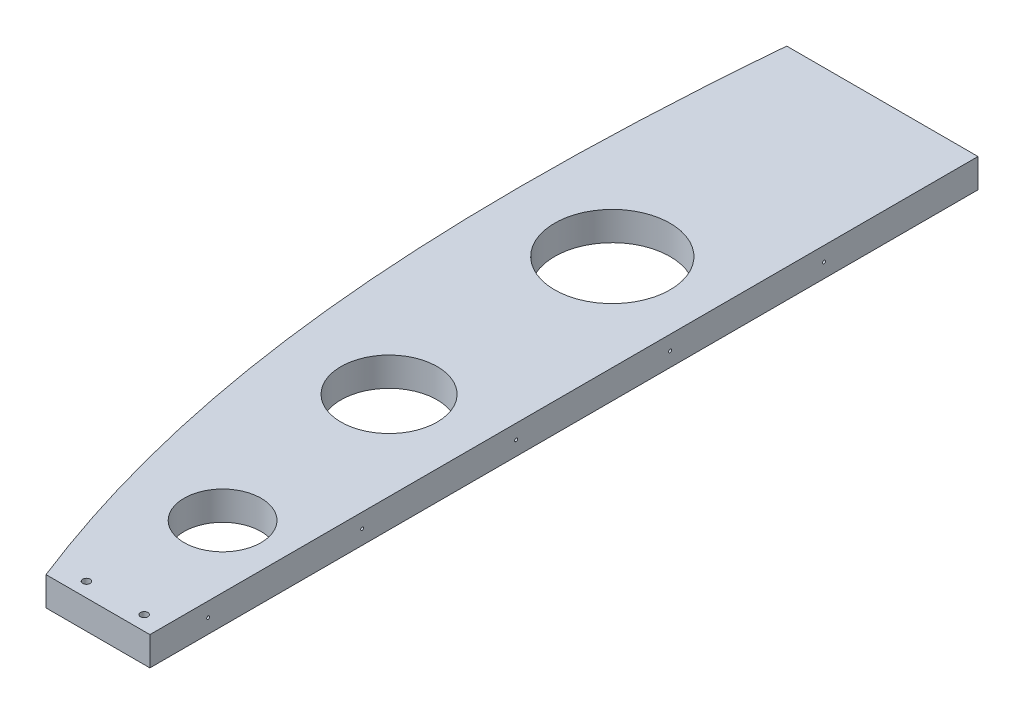
ISO-10303-21;
HEADER;
FILE_DESCRIPTION(('STEP AP214'),'2;1');
FILE_NAME('part.step','',(''),(''),'','','');
FILE_SCHEMA(('AUTOMOTIVE_DESIGN { 1 0 10303 214 1 1 1 1 }'));
ENDSEC;
DATA;
#1=APPLICATION_CONTEXT('core data for automotive mechanical design processes');
#2=APPLICATION_PROTOCOL_DEFINITION('international standard','automotive_design',2000,#1);
#3=PRODUCT_CONTEXT('',#1,'mechanical');
#4=PRODUCT('Part','Part','',(#3));
#5=PRODUCT_RELATED_PRODUCT_CATEGORY('part','',(#4));
#6=PRODUCT_DEFINITION_FORMATION('','',#4);
#7=PRODUCT_DEFINITION_CONTEXT('part definition',#1,'design');
#8=PRODUCT_DEFINITION('design','',#6,#7);
#9=PRODUCT_DEFINITION_SHAPE('','',#8);
#10=(LENGTH_UNIT() NAMED_UNIT(*) SI_UNIT(.MILLI.,.METRE.));
#11=(NAMED_UNIT(*) PLANE_ANGLE_UNIT() SI_UNIT($,.RADIAN.));
#12=(NAMED_UNIT(*) SI_UNIT($,.STERADIAN.) SOLID_ANGLE_UNIT());
#13=UNCERTAINTY_MEASURE_WITH_UNIT(LENGTH_MEASURE(1.E-05),#10,'distance_accuracy_value','');
#14=(GEOMETRIC_REPRESENTATION_CONTEXT(3) GLOBAL_UNCERTAINTY_ASSIGNED_CONTEXT((#13)) GLOBAL_UNIT_ASSIGNED_CONTEXT((#10,
#11,#12)) REPRESENTATION_CONTEXT('',''));
#15=CARTESIAN_POINT('',(0.,0.,0.));
#16=DIRECTION('',(0.,0.,1.));
#17=DIRECTION('',(1.,0.,0.));
#18=AXIS2_PLACEMENT_3D('',#15,#16,#17);
#19=CARTESIAN_POINT('',(-392.720476188399,5372.1,2956.72721358891));
#20=DIRECTION('',(0.,1.,0.));
#21=DIRECTION('',(0.,0.,1.));
#22=AXIS2_PLACEMENT_3D('',#19,#20,#21);
#23=PLANE('',#22);
#24=CARTESIAN_POINT('',(-376.528681754762,5372.1,3220.41942707641));
#25=DIRECTION('',(0.,-1.,0.));
#26=DIRECTION('',(0.,0.,1.));
#27=AXIS2_PLACEMENT_3D('',#24,#25,#26);
#28=CIRCLE('',#27,2.45744999999997);
#29=CARTESIAN_POINT('',(-376.528681754762,5372.1,3222.87687707641));
#30=VERTEX_POINT('',#29);
#31=EDGE_CURVE('E459',#30,#30,#28,.T.);
#32=ORIENTED_EDGE('',*,*,#31,.F.);
#33=EDGE_LOOP('',(#32));
#34=FACE_BOUND('',#33,.T.);
#35=CARTESIAN_POINT('',(-338.428578956923,5372.1,3220.4194270765));
#36=DIRECTION('',(0.,-1.,0.));
#37=DIRECTION('',(0.,0.,1.));
#38=AXIS2_PLACEMENT_3D('',#35,#36,#37);
#39=CIRCLE('',#38,2.45744999999997);
#40=CARTESIAN_POINT('',(-338.428578956923,5372.1,3222.8768770765));
#41=VERTEX_POINT('',#40);
#42=EDGE_CURVE('E116',#41,#41,#39,.T.);
#43=ORIENTED_EDGE('',*,*,#42,.F.);
#44=EDGE_LOOP('',(#43));
#45=FACE_BOUND('',#44,.T.);
#46=CARTESIAN_POINT('',(-388.619999999992,5372.1,2861.31));
#47=DIRECTION('',(0.,-1.,0.));
#48=DIRECTION('',(1.,0.,0.));
#49=AXIS2_PLACEMENT_3D('',#46,#47,#48);
#50=CIRCLE('',#49,38.0999999999997);
#51=CARTESIAN_POINT('',(-350.519999999992,5372.1,2861.31));
#52=VERTEX_POINT('',#51);
#53=EDGE_CURVE('E156',#52,#52,#50,.T.);
#54=ORIENTED_EDGE('',*,*,#53,.F.);
#55=EDGE_LOOP('',(#54));
#56=FACE_BOUND('',#55,.T.);
#57=CARTESIAN_POINT('',(-383.539999999992,5372.1,3013.71));
#58=DIRECTION('',(0.,-1.,0.));
#59=DIRECTION('',(1.,0.,0.));
#60=AXIS2_PLACEMENT_3D('',#57,#58,#59);
#61=CIRCLE('',#60,31.75);
#62=CARTESIAN_POINT('',(-351.789999999992,5372.1,3013.71));
#63=VERTEX_POINT('',#62);
#64=EDGE_CURVE('E484',#63,#63,#61,.T.);
#65=ORIENTED_EDGE('',*,*,#64,.F.);
#66=EDGE_LOOP('',(#65));
#67=FACE_BOUND('',#66,.T.);
#68=CARTESIAN_POINT('',(-366.394999999992,5372.1,3140.71));
#69=DIRECTION('',(0.,-1.,0.));
#70=DIRECTION('',(1.,0.,0.));
#71=AXIS2_PLACEMENT_3D('',#68,#69,#70);
#72=CIRCLE('',#71,25.4);
#73=CARTESIAN_POINT('',(-340.994999999992,5372.1,3140.71));
#74=VERTEX_POINT('',#73);
#75=EDGE_CURVE('E169',#74,#74,#72,.T.);
#76=ORIENTED_EDGE('',*,*,#75,.F.);
#77=EDGE_LOOP('',(#76));
#78=FACE_BOUND('',#77,.T.);
#79=DIRECTION('',(0.,0.,1.));
#80=VECTOR('',#79,1.);
#81=CARTESIAN_POINT('',(-325.12,5372.1,2683.51));
#82=LINE('',#81,#80);
#83=CARTESIAN_POINT('',(-325.12,5372.1,2683.51));
#84=VERTEX_POINT('',#83);
#85=CARTESIAN_POINT('',(-325.12,5372.1,3229.94442717783));
#86=VERTEX_POINT('',#85);
#87=EDGE_CURVE('E161',#84,#86,#82,.T.);
#88=ORIENTED_EDGE('',*,*,#87,.T.);
#89=DIRECTION('',(-1.,0.,0.));
#90=VECTOR('',#89,1.);
#91=CARTESIAN_POINT('',(-325.12,5372.1,3229.94442717783));
#92=LINE('',#91,#90);
#93=CARTESIAN_POINT('',(-393.682548612297,5372.1,3229.94442717783));
#94=VERTEX_POINT('',#93);
#95=EDGE_CURVE('E187',#86,#94,#92,.T.);
#96=ORIENTED_EDGE('',*,*,#95,.T.);
#97=CARTESIAN_POINT('',(-393.682548612297,5372.1,3229.94442717783));
#98=CARTESIAN_POINT('',(-394.456887278261,5372.1,3227.97409267507));
#99=CARTESIAN_POINT('',(-395.224418386659,5372.1,3226.00108202925));
#100=CARTESIAN_POINT('',(-396.745699742087,5372.1,3222.04984801669));
#101=CARTESIAN_POINT('',(-397.499450552644,5372.1,3220.07162486692));
#102=CARTESIAN_POINT('',(-398.993053269483,5372.1,3216.10998577864));
#103=CARTESIAN_POINT('',(-399.732905469336,5372.1,3214.12656995082));
#104=CARTESIAN_POINT('',(-401.198834415247,5372.1,3210.1539474909));
#105=CARTESIAN_POINT('',(-401.92490676605,5372.1,3208.16473923706));
#106=CARTESIAN_POINT('',(-403.362939318137,5372.1,3204.18117724008));
#107=CARTESIAN_POINT('',(-404.074899215258,5372.1,3202.18682338709));
#108=CARTESIAN_POINT('',(-405.484616665228,5372.1,3198.19301213818));
#109=CARTESIAN_POINT('',(-406.182373587812,5372.1,3196.19355452019));
#110=CARTESIAN_POINT('',(-408.953173030683,5372.1,3188.16137490408));
#111=CARTESIAN_POINT('',(-410.968400672618,5372.1,3182.10857083572));
#112=CARTESIAN_POINT('',(-414.867042059988,5372.1,3169.9598314745));
#113=CARTESIAN_POINT('',(-416.750437957193,5372.1,3163.86389046404));
#114=CARTESIAN_POINT('',(-420.384172507284,5372.1,3151.63202096788));
#115=CARTESIAN_POINT('',(-422.13450234528,5372.1,3145.49608986225));
#116=CARTESIAN_POINT('',(-425.501734798348,5372.1,3133.18776982584));
#117=CARTESIAN_POINT('',(-427.118638031934,5372.1,3127.01538106421));
#118=CARTESIAN_POINT('',(-430.220289757622,5372.1,3114.6349025104));
#119=CARTESIAN_POINT('',(-431.704985678233,5372.1,3108.42679955208));
#120=CARTESIAN_POINT('',(-434.542919092933,5372.1,3095.98083496866));
#121=CARTESIAN_POINT('',(-435.896160515653,5372.1,3089.74297423873));
#122=CARTESIAN_POINT('',(-438.473419996919,5372.1,3077.24069251174));
#123=CARTESIAN_POINT('',(-439.697439319748,5372.1,3070.97627177516));
#124=CARTESIAN_POINT('',(-442.019093536706,5372.1,3058.4242371645));
#125=CARTESIAN_POINT('',(-443.116730957581,5372.1,3052.1366237567));
#126=CARTESIAN_POINT('',(-445.53190242202,5372.1,3037.45725662658));
#127=CARTESIAN_POINT('',(-446.8020226021,5372.1,3029.05767164538));
#128=CARTESIAN_POINT('',(-449.133660073008,5372.1,3012.22966620934));
#129=CARTESIAN_POINT('',(-450.195175381903,5372.1,3003.80124548132));
#130=CARTESIAN_POINT('',(-452.119865470589,5372.1,2986.92177852863));
#131=CARTESIAN_POINT('',(-452.983038440592,5372.1,2978.47073209822));
#132=CARTESIAN_POINT('',(-454.52182313745,5372.1,2961.55244648694));
#133=CARTESIAN_POINT('',(-455.197451604686,5372.1,2953.08520881928));
#134=CARTESIAN_POINT('',(-456.372394967282,5372.1,2936.13867906095));
#135=CARTESIAN_POINT('',(-456.871712957139,5372.1,2927.65938718446));
#136=CARTESIAN_POINT('',(-457.49682462189,5372.1,2914.93467998271));
#137=CARTESIAN_POINT('',(-457.68454951338,5372.1,2910.69219806393));
#138=CARTESIAN_POINT('',(-458.020084952675,5372.1,2902.20564766661));
#139=CARTESIAN_POINT('',(-458.16789557835,5372.1,2897.96157919117));
#140=CARTESIAN_POINT('',(-458.39261386685,5372.1,2890.54167375211));
#141=CARTESIAN_POINT('',(-458.478002740263,5372.1,2887.36608909858));
#142=CARTESIAN_POINT('',(-458.62741559634,5372.1,2881.01442207913));
#143=CARTESIAN_POINT('',(-458.69143962297,5372.1,2877.83833971425));
#144=CARTESIAN_POINT('',(-458.798866254698,5372.1,2871.48592736605));
#145=CARTESIAN_POINT('',(-458.842269506911,5372.1,2868.30959739364));
#146=CARTESIAN_POINT('',(-458.909067808656,5372.1,2861.95672988344));
#147=CARTESIAN_POINT('',(-458.932462844902,5372.1,2858.78019234551));
#148=CARTESIAN_POINT('',(-458.973523832038,5372.1,2849.25164706475));
#149=CARTESIAN_POINT('',(-458.962085713271,5372.1,2842.8994936941));
#150=CARTESIAN_POINT('',(-458.865746069073,5372.1,2830.19568475043));
#151=CARTESIAN_POINT('',(-458.780843498029,5372.1,2823.84402918579));
#152=CARTESIAN_POINT('',(-458.555440423178,5372.1,2811.90254793619));
#153=CARTESIAN_POINT('',(-458.422814807489,5372.1,2806.31257153562));
#154=CARTESIAN_POINT('',(-458.105397741391,5372.1,2795.13403521731));
#155=CARTESIAN_POINT('',(-457.920605650512,5372.1,2789.54547531779));
#156=CARTESIAN_POINT('',(-457.50058654664,5372.1,2778.37016686811));
#157=CARTESIAN_POINT('',(-457.265358727712,5372.1,2772.78341834832));
#158=CARTESIAN_POINT('',(-456.745902375998,5372.1,2761.61213595354));
#159=CARTESIAN_POINT('',(-456.461673251714,5372.1,2756.0276021061));
#160=CARTESIAN_POINT('',(-455.845303056687,5372.1,2744.86008184125));
#161=CARTESIAN_POINT('',(-455.513152591962,5372.1,2739.27709594277));
#162=CARTESIAN_POINT('',(-454.801842865255,5372.1,2728.11418570015));
#163=CARTESIAN_POINT('',(-454.422684125743,5372.1,2722.53426132267));
#164=CARTESIAN_POINT('',(-453.617925963619,5372.1,2711.3779283249));
#165=CARTESIAN_POINT('',(-453.192327964684,5372.1,2705.80151960208));
#166=CARTESIAN_POINT('',(-452.519277338355,5372.1,2697.4398551389));
#167=CARTESIAN_POINT('',(-452.289157668395,5372.1,2694.65319423764));
#168=CARTESIAN_POINT('',(-451.817351920112,5372.1,2689.08085188907));
#169=CARTESIAN_POINT('',(-451.575665842301,5372.1,2686.29517044172));
#170=CARTESIAN_POINT('',(-451.328190233737,5372.1,2683.51));
#171=B_SPLINE_CURVE_WITH_KNOTS('',3,(#97,#98,#99,#100,#101,#102,#103,#104,#105,#106,#107,#108,
#109,#110,#111,#112,#113,#114,#115,#116,#117,#118,#119,#120,#121,#122,#123,#124,#125,#126,#127,
#128,#129,#130,#131,#132,#133,#134,#135,#136,#137,#138,#139,#140,#141,#142,#143,#144,#145,#146,
#147,#148,#149,#150,#151,#152,#153,#154,#155,#156,#157,#158,#159,#160,#161,#162,#163,#164,#165,
#166,#167,#168,#169,#170),.UNSPECIFIED.,.F.,.F.,(4,2,2,2,2,2,2,2,2,2,2,2,2,2,2,2,2,2,2,2,2,2,2,
2,2,2,2,2,2,2,2,2,2,2,2,2,4),(0.,6.35108009996956,12.7018998972628,19.0525853991757,
25.4052635958806,31.7580785621476,38.1111748266912,57.2478936892729,76.3871984126718,
95.527769906086,114.66825266624,133.816312856681,152.96380061474,172.111101020311,
191.258018548431,216.74035075125,242.222925047358,267.705731851513,293.186263306885,
318.666347521117,331.40609726997,344.145822164442,353.675953643452,363.206065510394,
372.735878286335,382.265697390113,401.3216964695,420.377966775742,437.152367296034,
453.926973771489,470.701848315528,487.476925363987,504.255295296115,521.033478762763,
537.811148008957,546.199566113043,554.587983845863),.UNSPECIFIED.);
#172=CARTESIAN_POINT('',(-451.328190233737,5372.1,2683.51));
#173=VERTEX_POINT('',#172);
#174=EDGE_CURVE('E174',#94,#173,#171,.T.);
#175=ORIENTED_EDGE('',*,*,#174,.T.);
#176=DIRECTION('',(1.,0.,0.));
#177=VECTOR('',#176,1.);
#178=CARTESIAN_POINT('',(-451.328190233737,5372.1,2683.51));
#179=LINE('',#178,#177);
#180=EDGE_CURVE('E162',#173,#84,#179,.T.);
#181=ORIENTED_EDGE('',*,*,#180,.T.);
#182=EDGE_LOOP('',(#88,#96,#175,#181));
#183=FACE_BOUND('',#182,.T.);
#184=ADVANCED_FACE('F37',(#34,#45,#56,#67,#78,#183),#23,.F.);
#185=CARTESIAN_POINT('',(-325.12,5372.1,3229.94442717783));
#186=DIRECTION('',(0.,0.,1.));
#187=DIRECTION('',(-1.,0.,0.));
#188=AXIS2_PLACEMENT_3D('',#185,#186,#187);
#189=PLANE('',#188);
#190=DIRECTION('',(-1.,0.,0.));
#191=VECTOR('',#190,1.);
#192=CARTESIAN_POINT('',(-392.720476188399,5391.15,3229.94442717783));
#193=LINE('',#192,#191);
#194=CARTESIAN_POINT('',(-325.12,5391.15,3229.94442717783));
#195=VERTEX_POINT('',#194);
#196=CARTESIAN_POINT('',(-393.682548612297,5391.15,3229.94442717783));
#197=VERTEX_POINT('',#196);
#198=EDGE_CURVE('E154',#195,#197,#193,.T.);
#199=ORIENTED_EDGE('',*,*,#198,.T.);
#200=DIRECTION('',(0.,-1.,0.));
#201=VECTOR('',#200,1.);
#202=CARTESIAN_POINT('',(-393.682548612297,5381.625,3229.94442717783));
#203=LINE('',#202,#201);
#204=EDGE_CURVE('E82',#197,#94,#203,.T.);
#205=ORIENTED_EDGE('',*,*,#204,.T.);
#206=ORIENTED_EDGE('',*,*,#95,.F.);
#207=DIRECTION('',(0.,1.,0.));
#208=VECTOR('',#207,1.);
#209=CARTESIAN_POINT('',(-325.12,5372.1,3229.94442717783));
#210=LINE('',#209,#208);
#211=EDGE_CURVE('E170',#86,#195,#210,.T.);
#212=ORIENTED_EDGE('',*,*,#211,.T.);
#213=EDGE_LOOP('',(#199,#205,#206,#212));
#214=FACE_BOUND('',#213,.T.);
#215=ADVANCED_FACE('F232',(#214),#189,.T.);
#216=CARTESIAN_POINT('',(-393.682548612297,5372.1,3229.94442717783));
#217=CARTESIAN_POINT('',(-393.682548612297,5391.15,3229.94442717783));
#218=CARTESIAN_POINT('',(-433.140972393041,5372.1,3129.54068836821));
#219=CARTESIAN_POINT('',(-433.140972393041,5391.15,3129.54068836821));
#220=CARTESIAN_POINT('',(-454.834742459105,5372.1,3022.43692802554));
#221=CARTESIAN_POINT('',(-454.834742459105,5391.15,3022.43692802554));
#222=CARTESIAN_POINT('',(-460.312828518181,5372.1,2819.19788970161));
#223=CARTESIAN_POINT('',(-460.312828518181,5391.15,2819.19788970161));
#224=CARTESIAN_POINT('',(-457.003208667205,5372.1,2747.37762040659));
#225=CARTESIAN_POINT('',(-457.003208667205,5391.15,2747.37762040659));
#226=CARTESIAN_POINT('',(-451.328190233737,5372.1,2683.51));
#227=CARTESIAN_POINT('',(-451.328190233737,5391.15,2683.51));
#228=B_SPLINE_SURFACE_WITH_KNOTS('',3,1,((#216,#217),(#218,#219),(#220,#221),(#222,#223),(#224,
#225),(#226,#227)),.UNSPECIFIED.,.F.,.F.,.F.,(4,2,4),(2,2),(-54.2493510406912,-24.5787816023228,
-9.05068072297407),(0.,1.90499999999997),.UNSPECIFIED.);
#229=CARTESIAN_POINT('',(-393.682548612297,5391.15,3229.94442717783));
#230=CARTESIAN_POINT('',(-394.45688727826,5391.15,3227.97409267507));
#231=CARTESIAN_POINT('',(-395.224418386658,5391.15,3226.00108202925));
#232=CARTESIAN_POINT('',(-396.745699742086,5391.15,3222.04984801669));
#233=CARTESIAN_POINT('',(-397.499450552644,5391.15,3220.07162486692));
#234=CARTESIAN_POINT('',(-398.993053269483,5391.15,3216.10998577864));
#235=CARTESIAN_POINT('',(-399.732905469336,5391.15,3214.12656995082));
#236=CARTESIAN_POINT('',(-401.198834415247,5391.15,3210.1539474909));
#237=CARTESIAN_POINT('',(-401.924906766051,5391.15,3208.16473923706));
#238=CARTESIAN_POINT('',(-403.362939318138,5391.15,3204.18117724008));
#239=CARTESIAN_POINT('',(-404.074899215258,5391.15,3202.18682338709));
#240=CARTESIAN_POINT('',(-405.484616665227,5391.15,3198.19301213818));
#241=CARTESIAN_POINT('',(-406.182373587811,5391.15,3196.19355452019));
#242=CARTESIAN_POINT('',(-408.953173030683,5391.15,3188.16137490408));
#243=CARTESIAN_POINT('',(-410.968400672618,5391.15,3182.10857083572));
#244=CARTESIAN_POINT('',(-414.867042059988,5391.15,3169.9598314745));
#245=CARTESIAN_POINT('',(-416.750437957193,5391.15,3163.86389046404));
#246=CARTESIAN_POINT('',(-420.384172507284,5391.15,3151.63202096788));
#247=CARTESIAN_POINT('',(-422.13450234528,5391.15,3145.49608986225));
#248=CARTESIAN_POINT('',(-425.501734798348,5391.15,3133.18776982584));
#249=CARTESIAN_POINT('',(-427.118638031934,5391.15,3127.01538106421));
#250=CARTESIAN_POINT('',(-430.220289757622,5391.15,3114.6349025104));
#251=CARTESIAN_POINT('',(-431.704985678233,5391.15,3108.42679955208));
#252=CARTESIAN_POINT('',(-434.542919092933,5391.15,3095.98083496866));
#253=CARTESIAN_POINT('',(-435.896160515653,5391.15,3089.74297423873));
#254=CARTESIAN_POINT('',(-438.473419996919,5391.15,3077.24069251174));
#255=CARTESIAN_POINT('',(-439.697439319748,5391.15,3070.97627177516));
#256=CARTESIAN_POINT('',(-442.019093536706,5391.15,3058.4242371645));
#257=CARTESIAN_POINT('',(-443.116730957581,5391.15,3052.1366237567));
#258=CARTESIAN_POINT('',(-445.53190242202,5391.15,3037.45725662658));
#259=CARTESIAN_POINT('',(-446.8020226021,5391.15,3029.05767164538));
#260=CARTESIAN_POINT('',(-449.133660073008,5391.15,3012.22966620934));
#261=CARTESIAN_POINT('',(-450.195175381904,5391.15,3003.80124548132));
#262=CARTESIAN_POINT('',(-452.119865470589,5391.15,2986.92177852863));
#263=CARTESIAN_POINT('',(-452.983038440592,5391.15,2978.47073209822));
#264=CARTESIAN_POINT('',(-454.52182313745,5391.15,2961.55244648694));
#265=CARTESIAN_POINT('',(-455.197451604686,5391.15,2953.08520881928));
#266=CARTESIAN_POINT('',(-456.372394967282,5391.15,2936.13867906095));
#267=CARTESIAN_POINT('',(-456.871712957139,5391.15,2927.65938718446));
#268=CARTESIAN_POINT('',(-457.49682462189,5391.15,2914.93467998271));
#269=CARTESIAN_POINT('',(-457.68454951338,5391.15,2910.69219806393));
#270=CARTESIAN_POINT('',(-458.020084952675,5391.15,2902.20564766661));
#271=CARTESIAN_POINT('',(-458.16789557835,5391.15,2897.96157919117));
#272=CARTESIAN_POINT('',(-458.39261386685,5391.15,2890.54167375211));
#273=CARTESIAN_POINT('',(-458.478002740263,5391.15,2887.36608909858));
#274=CARTESIAN_POINT('',(-458.62741559634,5391.15,2881.01442207913));
#275=CARTESIAN_POINT('',(-458.69143962297,5391.15,2877.83833971425));
#276=CARTESIAN_POINT('',(-458.798866254698,5391.15,2871.48592736605));
#277=CARTESIAN_POINT('',(-458.842269506911,5391.15,2868.30959739364));
#278=CARTESIAN_POINT('',(-458.909067808656,5391.15,2861.95672988344));
#279=CARTESIAN_POINT('',(-458.932462844902,5391.15,2858.78019234551));
#280=CARTESIAN_POINT('',(-458.973523832038,5391.15,2849.25164706475));
#281=CARTESIAN_POINT('',(-458.962085713271,5391.15,2842.8994936941));
#282=CARTESIAN_POINT('',(-458.865746069073,5391.15,2830.19568475043));
#283=CARTESIAN_POINT('',(-458.780843498029,5391.15,2823.84402918579));
#284=CARTESIAN_POINT('',(-458.555440423178,5391.15,2811.90254793619));
#285=CARTESIAN_POINT('',(-458.422814807489,5391.15,2806.31257153562));
#286=CARTESIAN_POINT('',(-458.105397741391,5391.15,2795.13403521731));
#287=CARTESIAN_POINT('',(-457.920605650512,5391.15,2789.54547531779));
#288=CARTESIAN_POINT('',(-457.50058654664,5391.15,2778.37016686811));
#289=CARTESIAN_POINT('',(-457.265358727712,5391.15,2772.78341834832));
#290=CARTESIAN_POINT('',(-456.745902375998,5391.15,2761.61213595354));
#291=CARTESIAN_POINT('',(-456.461673251714,5391.15,2756.0276021061));
#292=CARTESIAN_POINT('',(-455.845303056687,5391.15,2744.86008184125));
#293=CARTESIAN_POINT('',(-455.513152591963,5391.15,2739.27709594277));
#294=CARTESIAN_POINT('',(-454.801842865255,5391.15,2728.11418570015));
#295=CARTESIAN_POINT('',(-454.422684125743,5391.15,2722.53426132267));
#296=CARTESIAN_POINT('',(-453.617925963619,5391.15,2711.3779283249));
#297=CARTESIAN_POINT('',(-453.192327964684,5391.15,2705.80151960208));
#298=CARTESIAN_POINT('',(-452.519277338355,5391.15,2697.4398551389));
#299=CARTESIAN_POINT('',(-452.289157668395,5391.15,2694.65319423764));
#300=CARTESIAN_POINT('',(-451.817351920112,5391.15,2689.08085188907));
#301=CARTESIAN_POINT('',(-451.575665842301,5391.15,2686.29517044172));
#302=CARTESIAN_POINT('',(-451.328190233737,5391.15,2683.51));
#303=B_SPLINE_CURVE_WITH_KNOTS('',3,(#229,#230,#231,#232,#233,#234,#235,#236,#237,#238,#239,
#240,#241,#242,#243,#244,#245,#246,#247,#248,#249,#250,#251,#252,#253,#254,#255,#256,#257,#258,
#259,#260,#261,#262,#263,#264,#265,#266,#267,#268,#269,#270,#271,#272,#273,#274,#275,#276,#277,
#278,#279,#280,#281,#282,#283,#284,#285,#286,#287,#288,#289,#290,#291,#292,#293,#294,#295,#296,
#297,#298,#299,#300,#301,#302),.UNSPECIFIED.,.F.,.F.,(4,2,2,2,2,2,2,2,2,2,2,2,2,2,2,2,2,2,2,2,2,
2,2,2,2,2,2,2,2,2,2,2,2,2,2,2,4),(0.,6.35108009996983,12.7018998972628,19.0525853991757,
25.4052635958808,31.7580785621479,38.1111748266912,57.2478936892729,76.3871984126718,
95.527769906086,114.66825266624,133.816312856681,152.96380061474,172.111101020311,
191.258018548431,216.74035075125,242.222925047358,267.705731851513,293.186263306885,
318.666347521117,331.40609726997,344.145822164442,353.675953643452,363.206065510394,
372.735878286335,382.265697390113,401.3216964695,420.377966775742,437.152367296034,
453.926973771489,470.701848315528,487.476925363987,504.255295296115,521.033478762763,
537.811148008957,546.199566113043,554.587983845863),.UNSPECIFIED.);
#304=CARTESIAN_POINT('',(-451.328190233737,5391.15,2683.51));
#305=VERTEX_POINT('',#304);
#306=EDGE_CURVE('E151',#197,#305,#303,.T.);
#307=DIRECTION('',(0.,1.,0.));
#308=VECTOR('',#307,1.);
#309=CARTESIAN_POINT('',(-451.328190233737,5372.1,2683.51));
#310=LINE('',#309,#308);
#311=EDGE_CURVE('E159',#305,#173,#310,.F.);
#312=ORIENTED_EDGE('',*,*,#306,.T.);
#313=ORIENTED_EDGE('',*,*,#311,.T.);
#314=ORIENTED_EDGE('',*,*,#174,.F.);
#315=ORIENTED_EDGE('',*,*,#204,.F.);
#316=EDGE_LOOP('',(#312,#313,#314,#315));
#317=FACE_BOUND('',#316,.T.);
#318=ADVANCED_FACE('F39',(#317),#228,.F.);
#319=CARTESIAN_POINT('',(-451.328190233737,5372.1,2683.51));
#320=DIRECTION('',(0.,0.,-1.));
#321=DIRECTION('',(1.,0.,0.));
#322=AXIS2_PLACEMENT_3D('',#319,#320,#321);
#323=PLANE('',#322);
#324=CARTESIAN_POINT('',(-419.531342480865,5381.625,2683.51));
#325=DIRECTION('',(0.,0.,1.));
#326=DIRECTION('',(1.,0.,0.));
#327=AXIS2_PLACEMENT_3D('',#324,#325,#326);
#328=CIRCLE('',#327,0.991870000000006);
#329=CARTESIAN_POINT('',(-418.539472480865,5381.625,2683.51));
#330=VERTEX_POINT('',#329);
#331=EDGE_CURVE('E143',#330,#330,#328,.T.);
#332=ORIENTED_EDGE('',*,*,#331,.T.);
#333=EDGE_LOOP('',(#332));
#334=FACE_BOUND('',#333,.T.);
#335=CARTESIAN_POINT('',(-356.590447493622,5381.625,2683.51));
#336=DIRECTION('',(0.,0.,1.));
#337=DIRECTION('',(1.,0.,0.));
#338=AXIS2_PLACEMENT_3D('',#335,#336,#337);
#339=CIRCLE('',#338,0.991870000000006);
#340=CARTESIAN_POINT('',(-355.598577493622,5381.625,2683.51));
#341=VERTEX_POINT('',#340);
#342=EDGE_CURVE('E147',#341,#341,#339,.T.);
#343=ORIENTED_EDGE('',*,*,#342,.T.);
#344=EDGE_LOOP('',(#343));
#345=FACE_BOUND('',#344,.T.);
#346=DIRECTION('',(-1.,0.,0.));
#347=VECTOR('',#346,1.);
#348=CARTESIAN_POINT('',(-392.720476188399,5391.15,2683.51));
#349=LINE('',#348,#347);
#350=CARTESIAN_POINT('',(-325.12,5391.15,2683.51));
#351=VERTEX_POINT('',#350);
#352=EDGE_CURVE('E148',#305,#351,#349,.F.);
#353=ORIENTED_EDGE('',*,*,#352,.T.);
#354=DIRECTION('',(0.,1.,0.));
#355=VECTOR('',#354,1.);
#356=CARTESIAN_POINT('',(-325.12,5372.1,2683.51));
#357=LINE('',#356,#355);
#358=EDGE_CURVE('E167',#351,#84,#357,.F.);
#359=ORIENTED_EDGE('',*,*,#358,.T.);
#360=ORIENTED_EDGE('',*,*,#180,.F.);
#361=ORIENTED_EDGE('',*,*,#311,.F.);
#362=EDGE_LOOP('',(#353,#359,#360,#361));
#363=FACE_BOUND('',#362,.T.);
#364=ADVANCED_FACE('F227',(#334,#345,#363),#323,.T.);
#365=CARTESIAN_POINT('',(-325.12,5372.1,2683.51));
#366=DIRECTION('',(1.,0.,0.));
#367=DIRECTION('',(0.,0.,1.));
#368=AXIS2_PLACEMENT_3D('',#365,#366,#367);
#369=PLANE('',#368);
#370=CARTESIAN_POINT('',(-325.12,5381.625,2785.11));
#371=DIRECTION('',(-1.,0.,0.));
#372=DIRECTION('',(0.,0.,1.));
#373=AXIS2_PLACEMENT_3D('',#370,#371,#372);
#374=CIRCLE('',#373,0.991870000000006);
#375=CARTESIAN_POINT('',(-325.12,5381.625,2786.10187));
#376=VERTEX_POINT('',#375);
#377=EDGE_CURVE('E44',#376,#376,#374,.T.);
#378=ORIENTED_EDGE('',*,*,#377,.T.);
#379=EDGE_LOOP('',(#378));
#380=FACE_BOUND('',#379,.T.);
#381=CARTESIAN_POINT('',(-325.12,5381.625,2886.71));
#382=DIRECTION('',(-1.,0.,0.));
#383=DIRECTION('',(0.,0.,1.));
#384=AXIS2_PLACEMENT_3D('',#381,#382,#383);
#385=CIRCLE('',#384,0.991870000000006);
#386=CARTESIAN_POINT('',(-325.12,5381.625,2887.70187));
#387=VERTEX_POINT('',#386);
#388=EDGE_CURVE('E127',#387,#387,#385,.T.);
#389=ORIENTED_EDGE('',*,*,#388,.T.);
#390=EDGE_LOOP('',(#389));
#391=FACE_BOUND('',#390,.T.);
#392=CARTESIAN_POINT('',(-325.12,5381.625,2988.31));
#393=DIRECTION('',(-1.,0.,0.));
#394=DIRECTION('',(0.,0.,1.));
#395=AXIS2_PLACEMENT_3D('',#392,#393,#394);
#396=CIRCLE('',#395,0.991870000000006);
#397=CARTESIAN_POINT('',(-325.12,5381.625,2989.30187));
#398=VERTEX_POINT('',#397);
#399=EDGE_CURVE('E131',#398,#398,#396,.T.);
#400=ORIENTED_EDGE('',*,*,#399,.T.);
#401=EDGE_LOOP('',(#400));
#402=FACE_BOUND('',#401,.T.);
#403=CARTESIAN_POINT('',(-325.12,5381.625,3089.91));
#404=DIRECTION('',(-1.,0.,0.));
#405=DIRECTION('',(0.,0.,1.));
#406=AXIS2_PLACEMENT_3D('',#403,#404,#405);
#407=CIRCLE('',#406,0.991870000000006);
#408=CARTESIAN_POINT('',(-325.12,5381.625,3090.90187));
#409=VERTEX_POINT('',#408);
#410=EDGE_CURVE('E135',#409,#409,#407,.T.);
#411=ORIENTED_EDGE('',*,*,#410,.T.);
#412=EDGE_LOOP('',(#411));
#413=FACE_BOUND('',#412,.T.);
#414=CARTESIAN_POINT('',(-325.12,5381.625,3191.51));
#415=DIRECTION('',(-1.,0.,0.));
#416=DIRECTION('',(0.,0.,1.));
#417=AXIS2_PLACEMENT_3D('',#414,#415,#416);
#418=CIRCLE('',#417,0.991870000000006);
#419=CARTESIAN_POINT('',(-325.12,5381.625,3192.50187));
#420=VERTEX_POINT('',#419);
#421=EDGE_CURVE('E139',#420,#420,#418,.T.);
#422=ORIENTED_EDGE('',*,*,#421,.T.);
#423=EDGE_LOOP('',(#422));
#424=FACE_BOUND('',#423,.T.);
#425=DIRECTION('',(0.,0.,1.));
#426=VECTOR('',#425,1.);
#427=CARTESIAN_POINT('',(-325.12,5391.15,2956.72721358891));
#428=LINE('',#427,#426);
#429=EDGE_CURVE('E59',#351,#195,#428,.T.);
#430=ORIENTED_EDGE('',*,*,#429,.T.);
#431=ORIENTED_EDGE('',*,*,#211,.F.);
#432=ORIENTED_EDGE('',*,*,#87,.F.);
#433=ORIENTED_EDGE('',*,*,#358,.F.);
#434=EDGE_LOOP('',(#430,#431,#432,#433));
#435=FACE_BOUND('',#434,.T.);
#436=ADVANCED_FACE('F223',(#380,#391,#402,#413,#424,#435),#369,.T.);
#437=CARTESIAN_POINT('',(-366.395,5194.3,3140.71));
#438=DIRECTION('',(0.,1.,0.));
#439=DIRECTION('',(1.,0.,0.));
#440=AXIS2_PLACEMENT_3D('',#437,#438,#439);
#441=CYLINDRICAL_SURFACE('',#440,25.4);
#442=ORIENTED_EDGE('',*,*,#75,.T.);
#443=EDGE_LOOP('',(#442));
#444=FACE_BOUND('',#443,.T.);
#445=CARTESIAN_POINT('',(-366.394999999991,5391.15,3140.71));
#446=DIRECTION('',(0.,-1.,0.));
#447=DIRECTION('',(1.,0.,0.));
#448=AXIS2_PLACEMENT_3D('',#445,#446,#447);
#449=CIRCLE('',#448,25.4);
#450=CARTESIAN_POINT('',(-340.994999999991,5391.15,3140.71));
#451=VERTEX_POINT('',#450);
#452=EDGE_CURVE('E164',#451,#451,#449,.F.);
#453=ORIENTED_EDGE('',*,*,#452,.T.);
#454=EDGE_LOOP('',(#453));
#455=FACE_BOUND('',#454,.T.);
#456=ADVANCED_FACE('F219',(#444,#455),#441,.F.);
#457=CARTESIAN_POINT('',(-383.54,5194.3,3013.71));
#458=DIRECTION('',(0.,1.,0.));
#459=DIRECTION('',(1.,0.,0.));
#460=AXIS2_PLACEMENT_3D('',#457,#458,#459);
#461=CYLINDRICAL_SURFACE('',#460,31.75);
#462=ORIENTED_EDGE('',*,*,#64,.T.);
#463=EDGE_LOOP('',(#462));
#464=FACE_BOUND('',#463,.T.);
#465=CARTESIAN_POINT('',(-383.539999999991,5391.15,3013.71));
#466=DIRECTION('',(0.,-1.,0.));
#467=DIRECTION('',(1.,0.,0.));
#468=AXIS2_PLACEMENT_3D('',#465,#466,#467);
#469=CIRCLE('',#468,31.75);
#470=CARTESIAN_POINT('',(-351.789999999991,5391.15,3013.71));
#471=VERTEX_POINT('',#470);
#472=EDGE_CURVE('E50',#471,#471,#469,.F.);
#473=ORIENTED_EDGE('',*,*,#472,.T.);
#474=EDGE_LOOP('',(#473));
#475=FACE_BOUND('',#474,.T.);
#476=ADVANCED_FACE('F215',(#464,#475),#461,.F.);
#477=CARTESIAN_POINT('',(-388.62,5194.3,2861.31));
#478=DIRECTION('',(0.,1.,0.));
#479=DIRECTION('',(1.,0.,0.));
#480=AXIS2_PLACEMENT_3D('',#477,#478,#479);
#481=CYLINDRICAL_SURFACE('',#480,38.0999999999997);
#482=ORIENTED_EDGE('',*,*,#53,.T.);
#483=EDGE_LOOP('',(#482));
#484=FACE_BOUND('',#483,.T.);
#485=CARTESIAN_POINT('',(-388.619999999991,5391.15,2861.31));
#486=DIRECTION('',(0.,-1.,0.));
#487=DIRECTION('',(1.,0.,0.));
#488=AXIS2_PLACEMENT_3D('',#485,#486,#487);
#489=CIRCLE('',#488,38.0999999999997);
#490=CARTESIAN_POINT('',(-350.519999999992,5391.15,2861.31));
#491=VERTEX_POINT('',#490);
#492=EDGE_CURVE('E11',#491,#491,#489,.F.);
#493=ORIENTED_EDGE('',*,*,#492,.T.);
#494=EDGE_LOOP('',(#493));
#495=FACE_BOUND('',#494,.T.);
#496=ADVANCED_FACE('F210',(#484,#495),#481,.F.);
#497=CARTESIAN_POINT('',(-392.720476188399,5391.15,2956.72721358891));
#498=DIRECTION('',(0.,1.,0.));
#499=DIRECTION('',(0.,0.,1.));
#500=AXIS2_PLACEMENT_3D('',#497,#498,#499);
#501=PLANE('',#500);
#502=CARTESIAN_POINT('',(-376.528681754762,5391.15,3220.41942707641));
#503=DIRECTION('',(0.,-1.,0.));
#504=DIRECTION('',(0.,0.,1.));
#505=AXIS2_PLACEMENT_3D('',#502,#503,#504);
#506=CIRCLE('',#505,2.45744999999997);
#507=CARTESIAN_POINT('',(-376.528681754762,5391.15,3222.87687707641));
#508=VERTEX_POINT('',#507);
#509=EDGE_CURVE('E456',#508,#508,#506,.T.);
#510=ORIENTED_EDGE('',*,*,#509,.T.);
#511=EDGE_LOOP('',(#510));
#512=FACE_BOUND('',#511,.T.);
#513=CARTESIAN_POINT('',(-338.428578956923,5391.15,3220.4194270765));
#514=DIRECTION('',(0.,-1.,0.));
#515=DIRECTION('',(0.,0.,1.));
#516=AXIS2_PLACEMENT_3D('',#513,#514,#515);
#517=CIRCLE('',#516,2.45744999999997);
#518=CARTESIAN_POINT('',(-338.428578956923,5391.15,3222.8768770765));
#519=VERTEX_POINT('',#518);
#520=EDGE_CURVE('E121',#519,#519,#517,.T.);
#521=ORIENTED_EDGE('',*,*,#520,.T.);
#522=EDGE_LOOP('',(#521));
#523=FACE_BOUND('',#522,.T.);
#524=ORIENTED_EDGE('',*,*,#492,.F.);
#525=EDGE_LOOP('',(#524));
#526=FACE_BOUND('',#525,.T.);
#527=ORIENTED_EDGE('',*,*,#472,.F.);
#528=EDGE_LOOP('',(#527));
#529=FACE_BOUND('',#528,.T.);
#530=ORIENTED_EDGE('',*,*,#452,.F.);
#531=EDGE_LOOP('',(#530));
#532=FACE_BOUND('',#531,.T.);
#533=ORIENTED_EDGE('',*,*,#352,.F.);
#534=ORIENTED_EDGE('',*,*,#306,.F.);
#535=ORIENTED_EDGE('',*,*,#198,.F.);
#536=ORIENTED_EDGE('',*,*,#429,.F.);
#537=EDGE_LOOP('',(#533,#534,#535,#536));
#538=FACE_BOUND('',#537,.T.);
#539=ADVANCED_FACE('F204',(#512,#523,#526,#529,#532,#538),#501,.T.);
#540=CARTESIAN_POINT('',(-356.590447493622,5381.625,2702.56));
#541=DIRECTION('',(0.,0.,-1.));
#542=DIRECTION('',(1.,0.,0.));
#543=AXIS2_PLACEMENT_3D('',#540,#541,#542);
#544=CONICAL_SURFACE('',#543,0.991870000000006,1.02974425867677);
#545=CARTESIAN_POINT('',(-356.590447493622,5381.625,2703.1559756222));
#546=VERTEX_POINT('',#545);
#547=VERTEX_LOOP('',#546);
#548=FACE_BOUND('',#547,.T.);
#549=CARTESIAN_POINT('',(-356.590447493622,5381.625,2702.56));
#550=DIRECTION('',(0.,0.,1.));
#551=DIRECTION('',(1.,0.,0.));
#552=AXIS2_PLACEMENT_3D('',#549,#550,#551);
#553=CIRCLE('',#552,0.991870000000006);
#554=CARTESIAN_POINT('',(-355.598577493622,5381.625,2702.56));
#555=VERTEX_POINT('',#554);
#556=EDGE_CURVE('E144',#555,#555,#553,.T.);
#557=ORIENTED_EDGE('',*,*,#556,.F.);
#558=EDGE_LOOP('',(#557));
#559=FACE_BOUND('',#558,.T.);
#560=ADVANCED_FACE('F209',(#548,#559),#544,.F.);
#561=CARTESIAN_POINT('',(-356.590447493622,5381.625,2664.46));
#562=DIRECTION('',(0.,0.,-1.));
#563=DIRECTION('',(1.,0.,0.));
#564=AXIS2_PLACEMENT_3D('',#561,#562,#563);
#565=CYLINDRICAL_SURFACE('',#564,0.991870000000006);
#566=ORIENTED_EDGE('',*,*,#342,.F.);
#567=EDGE_LOOP('',(#566));
#568=FACE_BOUND('',#567,.T.);
#569=ORIENTED_EDGE('',*,*,#556,.T.);
#570=EDGE_LOOP('',(#569));
#571=FACE_BOUND('',#570,.T.);
#572=ADVANCED_FACE('F301',(#568,#571),#565,.F.);
#573=CARTESIAN_POINT('',(-419.531342480865,5381.625,2702.56));
#574=DIRECTION('',(0.,0.,-1.));
#575=DIRECTION('',(1.,0.,0.));
#576=AXIS2_PLACEMENT_3D('',#573,#574,#575);
#577=CONICAL_SURFACE('',#576,0.991870000000006,1.02974425867677);
#578=CARTESIAN_POINT('',(-419.531342480865,5381.625,2703.1559756222));
#579=VERTEX_POINT('',#578);
#580=VERTEX_LOOP('',#579);
#581=FACE_BOUND('',#580,.T.);
#582=CARTESIAN_POINT('',(-419.531342480865,5381.625,2702.56));
#583=DIRECTION('',(0.,0.,1.));
#584=DIRECTION('',(1.,0.,0.));
#585=AXIS2_PLACEMENT_3D('',#582,#583,#584);
#586=CIRCLE('',#585,0.991870000000006);
#587=CARTESIAN_POINT('',(-418.539472480865,5381.625,2702.56));
#588=VERTEX_POINT('',#587);
#589=EDGE_CURVE('E140',#588,#588,#586,.T.);
#590=ORIENTED_EDGE('',*,*,#589,.F.);
#591=EDGE_LOOP('',(#590));
#592=FACE_BOUND('',#591,.T.);
#593=ADVANCED_FACE('F298',(#581,#592),#577,.F.);
#594=CARTESIAN_POINT('',(-419.531342480865,5381.625,2664.46));
#595=DIRECTION('',(0.,0.,-1.));
#596=DIRECTION('',(1.,0.,0.));
#597=AXIS2_PLACEMENT_3D('',#594,#595,#596);
#598=CYLINDRICAL_SURFACE('',#597,0.991870000000006);
#599=ORIENTED_EDGE('',*,*,#331,.F.);
#600=EDGE_LOOP('',(#599));
#601=FACE_BOUND('',#600,.T.);
#602=ORIENTED_EDGE('',*,*,#589,.T.);
#603=EDGE_LOOP('',(#602));
#604=FACE_BOUND('',#603,.T.);
#605=ADVANCED_FACE('F294',(#601,#604),#598,.F.);
#606=CARTESIAN_POINT('',(-344.17,5381.625,3191.51));
#607=DIRECTION('',(1.,0.,0.));
#608=DIRECTION('',(0.,0.,1.));
#609=AXIS2_PLACEMENT_3D('',#606,#607,#608);
#610=CONICAL_SURFACE('',#609,0.991870000000006,1.02974425867665);
#611=CARTESIAN_POINT('',(-344.765975622195,5381.625,3191.51));
#612=VERTEX_POINT('',#611);
#613=VERTEX_LOOP('',#612);
#614=FACE_BOUND('',#613,.T.);
#615=CARTESIAN_POINT('',(-344.17,5381.625,3191.51));
#616=DIRECTION('',(-1.,0.,0.));
#617=DIRECTION('',(0.,0.,1.));
#618=AXIS2_PLACEMENT_3D('',#615,#616,#617);
#619=CIRCLE('',#618,0.991870000000006);
#620=CARTESIAN_POINT('',(-344.17,5381.625,3192.50187));
#621=VERTEX_POINT('',#620);
#622=EDGE_CURVE('E136',#621,#621,#619,.T.);
#623=ORIENTED_EDGE('',*,*,#622,.F.);
#624=EDGE_LOOP('',(#623));
#625=FACE_BOUND('',#624,.T.);
#626=ADVANCED_FACE('F290',(#614,#625),#610,.F.);
#627=CARTESIAN_POINT('',(-312.42,5381.625,3191.51));
#628=DIRECTION('',(1.,0.,0.));
#629=DIRECTION('',(0.,0.,1.));
#630=AXIS2_PLACEMENT_3D('',#627,#628,#629);
#631=CYLINDRICAL_SURFACE('',#630,0.991870000000006);
#632=ORIENTED_EDGE('',*,*,#421,.F.);
#633=EDGE_LOOP('',(#632));
#634=FACE_BOUND('',#633,.T.);
#635=ORIENTED_EDGE('',*,*,#622,.T.);
#636=EDGE_LOOP('',(#635));
#637=FACE_BOUND('',#636,.T.);
#638=ADVANCED_FACE('F286',(#634,#637),#631,.F.);
#639=CARTESIAN_POINT('',(-344.17,5381.625,3089.91));
#640=DIRECTION('',(1.,0.,0.));
#641=DIRECTION('',(0.,0.,1.));
#642=AXIS2_PLACEMENT_3D('',#639,#640,#641);
#643=CONICAL_SURFACE('',#642,0.991870000000006,1.02974425867665);
#644=CARTESIAN_POINT('',(-344.765975622195,5381.625,3089.91));
#645=VERTEX_POINT('',#644);
#646=VERTEX_LOOP('',#645);
#647=FACE_BOUND('',#646,.T.);
#648=CARTESIAN_POINT('',(-344.17,5381.625,3089.91));
#649=DIRECTION('',(-1.,0.,0.));
#650=DIRECTION('',(0.,0.,1.));
#651=AXIS2_PLACEMENT_3D('',#648,#649,#650);
#652=CIRCLE('',#651,0.991870000000006);
#653=CARTESIAN_POINT('',(-344.17,5381.625,3090.90187));
#654=VERTEX_POINT('',#653);
#655=EDGE_CURVE('E132',#654,#654,#652,.T.);
#656=ORIENTED_EDGE('',*,*,#655,.F.);
#657=EDGE_LOOP('',(#656));
#658=FACE_BOUND('',#657,.T.);
#659=ADVANCED_FACE('F282',(#647,#658),#643,.F.);
#660=CARTESIAN_POINT('',(-312.42,5381.625,3089.91));
#661=DIRECTION('',(1.,0.,0.));
#662=DIRECTION('',(0.,0.,1.));
#663=AXIS2_PLACEMENT_3D('',#660,#661,#662);
#664=CYLINDRICAL_SURFACE('',#663,0.991870000000006);
#665=ORIENTED_EDGE('',*,*,#410,.F.);
#666=EDGE_LOOP('',(#665));
#667=FACE_BOUND('',#666,.T.);
#668=ORIENTED_EDGE('',*,*,#655,.T.);
#669=EDGE_LOOP('',(#668));
#670=FACE_BOUND('',#669,.T.);
#671=ADVANCED_FACE('F278',(#667,#670),#664,.F.);
#672=CARTESIAN_POINT('',(-344.17,5381.625,2988.31));
#673=DIRECTION('',(1.,0.,0.));
#674=DIRECTION('',(0.,0.,1.));
#675=AXIS2_PLACEMENT_3D('',#672,#673,#674);
#676=CONICAL_SURFACE('',#675,0.991870000000006,1.02974425867665);
#677=CARTESIAN_POINT('',(-344.765975622195,5381.625,2988.31));
#678=VERTEX_POINT('',#677);
#679=VERTEX_LOOP('',#678);
#680=FACE_BOUND('',#679,.T.);
#681=CARTESIAN_POINT('',(-344.17,5381.625,2988.31));
#682=DIRECTION('',(-1.,0.,0.));
#683=DIRECTION('',(0.,0.,1.));
#684=AXIS2_PLACEMENT_3D('',#681,#682,#683);
#685=CIRCLE('',#684,0.991870000000006);
#686=CARTESIAN_POINT('',(-344.17,5381.625,2989.30187));
#687=VERTEX_POINT('',#686);
#688=EDGE_CURVE('E128',#687,#687,#685,.T.);
#689=ORIENTED_EDGE('',*,*,#688,.F.);
#690=EDGE_LOOP('',(#689));
#691=FACE_BOUND('',#690,.T.);
#692=ADVANCED_FACE('F272',(#680,#691),#676,.F.);
#693=CARTESIAN_POINT('',(-312.42,5381.625,2988.31));
#694=DIRECTION('',(1.,0.,0.));
#695=DIRECTION('',(0.,0.,1.));
#696=AXIS2_PLACEMENT_3D('',#693,#694,#695);
#697=CYLINDRICAL_SURFACE('',#696,0.991870000000006);
#698=ORIENTED_EDGE('',*,*,#399,.F.);
#699=EDGE_LOOP('',(#698));
#700=FACE_BOUND('',#699,.T.);
#701=ORIENTED_EDGE('',*,*,#688,.T.);
#702=EDGE_LOOP('',(#701));
#703=FACE_BOUND('',#702,.T.);
#704=ADVANCED_FACE('F266',(#700,#703),#697,.F.);
#705=CARTESIAN_POINT('',(-344.17,5381.625,2886.71));
#706=DIRECTION('',(1.,0.,0.));
#707=DIRECTION('',(0.,0.,1.));
#708=AXIS2_PLACEMENT_3D('',#705,#706,#707);
#709=CONICAL_SURFACE('',#708,0.991870000000006,1.02974425867665);
#710=CARTESIAN_POINT('',(-344.765975622195,5381.625,2886.71));
#711=VERTEX_POINT('',#710);
#712=VERTEX_LOOP('',#711);
#713=FACE_BOUND('',#712,.T.);
#714=CARTESIAN_POINT('',(-344.17,5381.625,2886.71));
#715=DIRECTION('',(-1.,0.,0.));
#716=DIRECTION('',(0.,0.,1.));
#717=AXIS2_PLACEMENT_3D('',#714,#715,#716);
#718=CIRCLE('',#717,0.991870000000006);
#719=CARTESIAN_POINT('',(-344.17,5381.625,2887.70187));
#720=VERTEX_POINT('',#719);
#721=EDGE_CURVE('E119',#720,#720,#718,.T.);
#722=ORIENTED_EDGE('',*,*,#721,.F.);
#723=EDGE_LOOP('',(#722));
#724=FACE_BOUND('',#723,.T.);
#725=ADVANCED_FACE('F261',(#713,#724),#709,.F.);
#726=CARTESIAN_POINT('',(-312.42,5381.625,2886.71));
#727=DIRECTION('',(1.,0.,0.));
#728=DIRECTION('',(0.,0.,1.));
#729=AXIS2_PLACEMENT_3D('',#726,#727,#728);
#730=CYLINDRICAL_SURFACE('',#729,0.991870000000006);
#731=ORIENTED_EDGE('',*,*,#388,.F.);
#732=EDGE_LOOP('',(#731));
#733=FACE_BOUND('',#732,.T.);
#734=ORIENTED_EDGE('',*,*,#721,.T.);
#735=EDGE_LOOP('',(#734));
#736=FACE_BOUND('',#735,.T.);
#737=ADVANCED_FACE('F110',(#733,#736),#730,.F.);
#738=CARTESIAN_POINT('',(-344.17,5381.625,2785.11));
#739=DIRECTION('',(1.,0.,0.));
#740=DIRECTION('',(0.,0.,1.));
#741=AXIS2_PLACEMENT_3D('',#738,#739,#740);
#742=CONICAL_SURFACE('',#741,0.991870000000006,1.02974425867665);
#743=CARTESIAN_POINT('',(-344.765975622195,5381.625,2785.11));
#744=VERTEX_POINT('',#743);
#745=VERTEX_LOOP('',#744);
#746=FACE_BOUND('',#745,.T.);
#747=CARTESIAN_POINT('',(-344.17,5381.625,2785.11));
#748=DIRECTION('',(-1.,0.,0.));
#749=DIRECTION('',(0.,0.,1.));
#750=AXIS2_PLACEMENT_3D('',#747,#748,#749);
#751=CIRCLE('',#750,0.991870000000006);
#752=CARTESIAN_POINT('',(-344.17,5381.625,2786.10187));
#753=VERTEX_POINT('',#752);
#754=EDGE_CURVE('E114',#753,#753,#751,.T.);
#755=ORIENTED_EDGE('',*,*,#754,.F.);
#756=EDGE_LOOP('',(#755));
#757=FACE_BOUND('',#756,.T.);
#758=ADVANCED_FACE('F106',(#746,#757),#742,.F.);
#759=CARTESIAN_POINT('',(-312.42,5381.625,2785.11));
#760=DIRECTION('',(1.,0.,0.));
#761=DIRECTION('',(0.,0.,1.));
#762=AXIS2_PLACEMENT_3D('',#759,#760,#761);
#763=CYLINDRICAL_SURFACE('',#762,0.991870000000006);
#764=ORIENTED_EDGE('',*,*,#377,.F.);
#765=EDGE_LOOP('',(#764));
#766=FACE_BOUND('',#765,.T.);
#767=ORIENTED_EDGE('',*,*,#754,.T.);
#768=EDGE_LOOP('',(#767));
#769=FACE_BOUND('',#768,.T.);
#770=ADVANCED_FACE('F109',(#766,#769),#763,.F.);
#771=CARTESIAN_POINT('',(-338.428578956923,5391.15,3220.4194270765));
#772=DIRECTION('',(0.,1.,0.));
#773=DIRECTION('',(0.,0.,1.));
#774=AXIS2_PLACEMENT_3D('',#771,#772,#773);
#775=CYLINDRICAL_SURFACE('',#774,2.45744999999997);
#776=ORIENTED_EDGE('',*,*,#520,.F.);
#777=EDGE_LOOP('',(#776));
#778=FACE_BOUND('',#777,.T.);
#779=ORIENTED_EDGE('',*,*,#42,.T.);
#780=EDGE_LOOP('',(#779));
#781=FACE_BOUND('',#780,.T.);
#782=ADVANCED_FACE('F429',(#778,#781),#775,.F.);
#783=CARTESIAN_POINT('',(-376.528681754762,5391.15,3220.41942707641));
#784=DIRECTION('',(0.,1.,0.));
#785=DIRECTION('',(0.,0.,1.));
#786=AXIS2_PLACEMENT_3D('',#783,#784,#785);
#787=CYLINDRICAL_SURFACE('',#786,2.45744999999997);
#788=ORIENTED_EDGE('',*,*,#509,.F.);
#789=EDGE_LOOP('',(#788));
#790=FACE_BOUND('',#789,.T.);
#791=ORIENTED_EDGE('',*,*,#31,.T.);
#792=EDGE_LOOP('',(#791));
#793=FACE_BOUND('',#792,.T.);
#794=ADVANCED_FACE('F439',(#790,#793),#787,.F.);
#795=CLOSED_SHELL('',(#184,#215,#318,#364,#436,#456,#476,#496,#539,#560,#572,#593,#605,#626,
#638,#659,#671,#692,#704,#725,#737,#758,#770,#782,#794));
#796=MANIFOLD_SOLID_BREP('B2',#795);
#797=ADVANCED_BREP_SHAPE_REPRESENTATION('',(#18,#796),#14);
#798=SHAPE_DEFINITION_REPRESENTATION(#9,#797);
ENDSEC;
END-ISO-10303-21;
